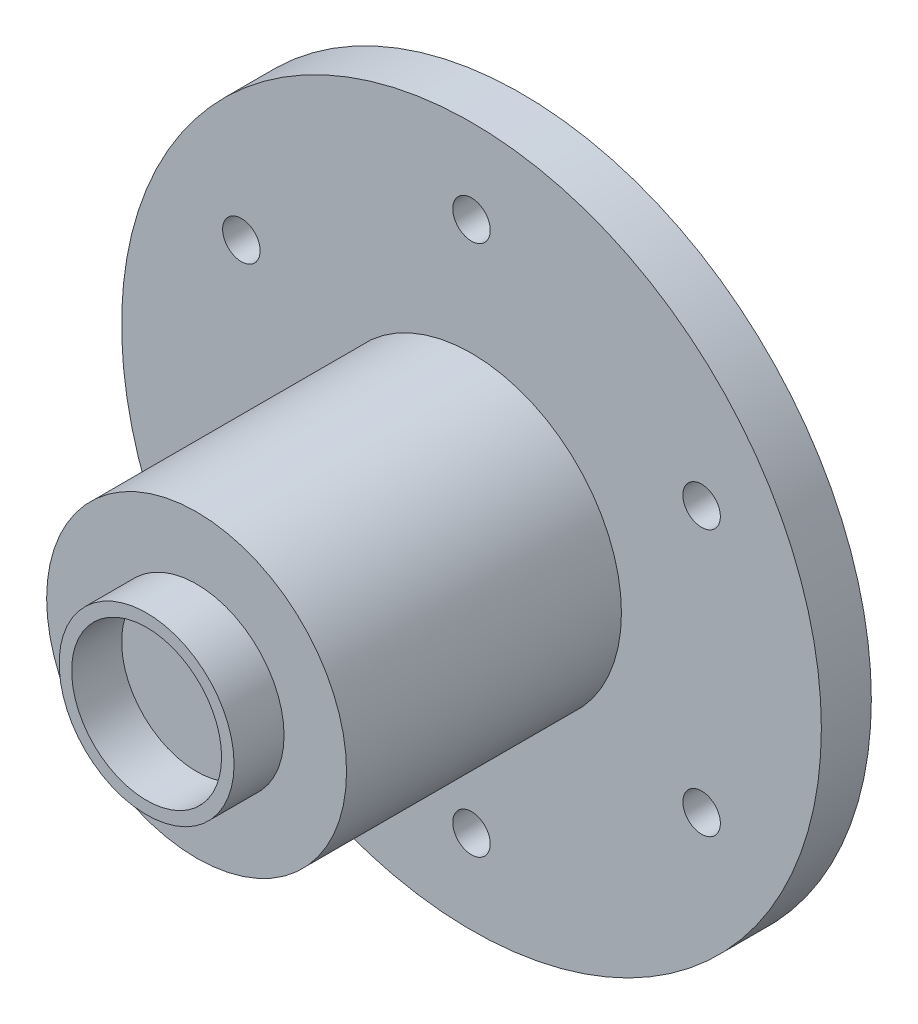
ISO-10303-21;
HEADER;
FILE_DESCRIPTION(('STEP AP214'),'2;1');
FILE_NAME('part.step','',(''),(''),'','','');
FILE_SCHEMA(('AUTOMOTIVE_DESIGN { 1 0 10303 214 1 1 1 1 }'));
ENDSEC;
DATA;
#1=APPLICATION_CONTEXT('core data for automotive mechanical design processes');
#2=APPLICATION_PROTOCOL_DEFINITION('international standard','automotive_design',2000,#1);
#3=PRODUCT_CONTEXT('',#1,'mechanical');
#4=PRODUCT('Part','Part','',(#3));
#5=PRODUCT_RELATED_PRODUCT_CATEGORY('part','',(#4));
#6=PRODUCT_DEFINITION_FORMATION('','',#4);
#7=PRODUCT_DEFINITION_CONTEXT('part definition',#1,'design');
#8=PRODUCT_DEFINITION('design','',#6,#7);
#9=PRODUCT_DEFINITION_SHAPE('','',#8);
#10=(LENGTH_UNIT() NAMED_UNIT(*) SI_UNIT(.MILLI.,.METRE.));
#11=(NAMED_UNIT(*) PLANE_ANGLE_UNIT() SI_UNIT($,.RADIAN.));
#12=(NAMED_UNIT(*) SI_UNIT($,.STERADIAN.) SOLID_ANGLE_UNIT());
#13=UNCERTAINTY_MEASURE_WITH_UNIT(LENGTH_MEASURE(1.E-05),#10,'distance_accuracy_value','');
#14=(GEOMETRIC_REPRESENTATION_CONTEXT(3) GLOBAL_UNCERTAINTY_ASSIGNED_CONTEXT((#13)) GLOBAL_UNIT_ASSIGNED_CONTEXT((#10,
#11,#12)) REPRESENTATION_CONTEXT('',''));
#15=CARTESIAN_POINT('',(0.,0.,0.));
#16=DIRECTION('',(0.,0.,1.));
#17=DIRECTION('',(1.,0.,0.));
#18=AXIS2_PLACEMENT_3D('',#15,#16,#17);
#19=CARTESIAN_POINT('',(0.,0.,-34.));
#20=DIRECTION('',(0.,0.,1.));
#21=DIRECTION('',(1.,0.,0.));
#22=AXIS2_PLACEMENT_3D('',#19,#20,#21);
#23=CYLINDRICAL_SURFACE('',#22,5.);
#24=CARTESIAN_POINT('',(0.,0.,0.));
#25=DIRECTION('',(0.,0.,1.));
#26=DIRECTION('',(1.,0.,0.));
#27=AXIS2_PLACEMENT_3D('',#24,#25,#26);
#28=CIRCLE('',#27,5.);
#29=CARTESIAN_POINT('',(5.,0.,0.));
#30=VERTEX_POINT('',#29);
#31=EDGE_CURVE('E123',#30,#30,#28,.T.);
#32=ORIENTED_EDGE('',*,*,#31,.F.);
#33=EDGE_LOOP('',(#32));
#34=FACE_BOUND('',#33,.T.);
#35=CARTESIAN_POINT('',(0.,-5.,17.723306720916));
#36=CARTESIAN_POINT('',(-0.0822886127532998,-4.9999992925055,17.7233057234311));
#37=CARTESIAN_POINT('',(-0.164587318351529,-4.99794915693954,17.716512857292));
#38=CARTESIAN_POINT('',(-0.32678812530488,-4.98997105593691,17.6895853666939));
#39=CARTESIAN_POINT('',(-0.406689504411419,-4.98404193389692,17.6694467628927));
#40=CARTESIAN_POINT('',(-0.561732707754526,-4.96895552501836,17.6165607040057));
#41=CARTESIAN_POINT('',(-0.636881364395372,-4.95980300250425,17.5838318512971));
#42=CARTESIAN_POINT('',(-0.78062418105313,-4.93922109237645,17.5067706278602));
#43=CARTESIAN_POINT('',(-0.849217467469668,-4.92779140192067,17.4624367135206));
#44=CARTESIAN_POINT('',(-0.979871797183743,-4.90350737192774,17.3620827134433));
#45=CARTESIAN_POINT('',(-1.04171807124434,-4.89062383657036,17.3057900950301));
#46=CARTESIAN_POINT('',(-1.15524920923324,-4.86505834210442,17.1836974910058));
#47=CARTESIAN_POINT('',(-1.20693236327441,-4.85237641724501,17.117895908791));
#48=CARTESIAN_POINT('',(-1.29980037723707,-4.82834113993772,16.9768359678784));
#49=CARTESIAN_POINT('',(-1.34072309022213,-4.81702406663875,16.9013982599253));
#50=CARTESIAN_POINT('',(-1.4092139477476,-4.79743620394031,16.7443174666857));
#51=CARTESIAN_POINT('',(-1.43678529919973,-4.78916468313311,16.662675876988));
#52=CARTESIAN_POINT('',(-1.47701633682652,-4.77690870838434,16.4979164547855));
#53=CARTESIAN_POINT('',(-1.49007196234677,-4.77281069324533,16.414903977052));
#54=CARTESIAN_POINT('',(-1.50213730614672,-4.76902789749767,16.2477735646992));
#55=CARTESIAN_POINT('',(-1.50115042761078,-4.76934204760571,16.1636559028569));
#56=CARTESIAN_POINT('',(-1.48546977199812,-4.77424744067778,15.9999228123075));
#57=CARTESIAN_POINT('',(-1.47127205262685,-4.7786838859914,15.9202544705538));
#58=CARTESIAN_POINT('',(-1.43037420427056,-4.79108356228624,15.7644869346425));
#59=CARTESIAN_POINT('',(-1.40367284141641,-4.79904714132351,15.6883880935417));
#60=CARTESIAN_POINT('',(-1.33816026653682,-4.81772733074973,15.5407063712553));
#61=CARTESIAN_POINT('',(-1.29918816934643,-4.82848016115952,15.4691996369607));
#62=CARTESIAN_POINT('',(-1.21035222588683,-4.85150987000064,15.3335746989058));
#63=CARTESIAN_POINT('',(-1.16048574002588,-4.86378711746991,15.2694582915022));
#64=CARTESIAN_POINT('',(-1.04881290765546,-4.88911011297937,15.147620530154));
#65=CARTESIAN_POINT('',(-0.986594907466972,-4.90216654310498,15.0902780568863));
#66=CARTESIAN_POINT('',(-0.853263259313967,-4.92712244063259,14.9867527368517));
#67=CARTESIAN_POINT('',(-0.782149051860888,-4.9390218351841,14.9405705925016));
#68=CARTESIAN_POINT('',(-0.632355038342804,-4.9604316006947,14.8604467984513));
#69=CARTESIAN_POINT('',(-0.553627749747951,-4.96992543668314,14.8265892046661));
#70=CARTESIAN_POINT('',(-0.391245415603519,-4.98533521832222,14.7727071308164));
#71=CARTESIAN_POINT('',(-0.307591751589582,-4.99125216186999,14.7526787923835));
#72=CARTESIAN_POINT('',(-0.140952242668332,-4.99868364643538,14.7276545430166));
#73=CARTESIAN_POINT('',(-0.0580500976011873,-5.0003485041779,14.7221451351144));
#74=CARTESIAN_POINT('',(0.107499605823383,-4.9995292324176,14.7248758766281));
#75=CARTESIAN_POINT('',(0.19014719669078,-4.99704565677756,14.7331141905674));
#76=CARTESIAN_POINT('',(0.350903605309696,-4.98830696987163,14.7626913320275));
#77=CARTESIAN_POINT('',(0.429072772614169,-4.98213829799417,14.7837301084969));
#78=CARTESIAN_POINT('',(0.580754638954521,-4.96674347841533,14.8379499536942));
#79=CARTESIAN_POINT('',(0.654266777025583,-4.95751696321085,14.8711324819539));
#80=CARTESIAN_POINT('',(0.796437189461052,-4.93669654351325,14.9495598863971));
#81=CARTESIAN_POINT('',(0.864943826199669,-4.92505280829675,14.995066061864));
#82=CARTESIAN_POINT('',(0.993523307980147,-4.90073468764318,15.0965314749688));
#83=CARTESIAN_POINT('',(1.05359403235593,-4.8880600443108,15.1524933328037));
#84=CARTESIAN_POINT('',(1.16585744551027,-4.86253171869138,15.2756940292853));
#85=CARTESIAN_POINT('',(1.21768481231504,-4.84968825033268,15.3432685966877));
#86=CARTESIAN_POINT('',(1.30928995072154,-4.82576515238463,15.4864346599295));
#87=CARTESIAN_POINT('',(1.34906803829472,-4.81468547654651,15.5620259454742));
#88=CARTESIAN_POINT('',(1.41517347127168,-4.79567189615055,15.7188392121707));
#89=CARTESIAN_POINT('',(1.4415634693705,-4.78772337843827,15.8000329074526));
#90=CARTESIAN_POINT('',(1.48021730815114,-4.77591594362794,15.9659946898475));
#91=CARTESIAN_POINT('',(1.49248598978779,-4.772055625083,16.0507615417037));
#92=CARTESIAN_POINT('',(1.50221984485059,-4.76899972496087,16.2176682392922));
#93=CARTESIAN_POINT('',(1.5002805530849,-4.76961647442754,16.2997703719336));
#94=CARTESIAN_POINT('',(1.48307505444813,-4.77499401288294,16.4624208242888));
#95=CARTESIAN_POINT('',(1.46780938124716,-4.77975463592551,16.5429692060923));
#96=CARTESIAN_POINT('',(1.42476888804136,-4.79275763670385,16.6992521200588));
#97=CARTESIAN_POINT('',(1.39715175507069,-4.80095604545965,16.7750340082777));
#98=CARTESIAN_POINT('',(1.33031507121129,-4.81990278909136,16.9209491597337));
#99=CARTESIAN_POINT('',(1.29109329962876,-4.83065161194312,16.9910813385567));
#100=CARTESIAN_POINT('',(1.20048763805072,-4.85397676425833,17.1264698374431));
#101=CARTESIAN_POINT('',(1.14871276092994,-4.86660540163797,17.1914554821764));
#102=CARTESIAN_POINT('',(1.03517434629782,-4.89201320450026,17.3120092192239));
#103=CARTESIAN_POINT('',(0.973408217134502,-4.90479240823905,17.3675748603838));
#104=CARTESIAN_POINT('',(0.839465762183249,-4.92950936570649,17.469330133211));
#105=CARTESIAN_POINT('',(0.767037885790609,-4.94141159765674,17.5151981677715));
#106=CARTESIAN_POINT('',(0.615141373983531,-4.96260680455813,17.59404189082));
#107=CARTESIAN_POINT('',(0.535676052998956,-4.97190099931067,17.6270236091905));
#108=CARTESIAN_POINT('',(0.380757712655282,-4.98602174969301,17.6762019965687));
#109=CARTESIAN_POINT('',(0.305786961954235,-4.99122027381068,17.6938183937992));
#110=CARTESIAN_POINT('',(0.15388019523078,-4.99820944494492,17.7173702461576));
#111=CARTESIAN_POINT('',(0.0769445098581401,-5.0000006615474,17.7233076536208));
#112=CARTESIAN_POINT('',(0.,-5.,17.723306720916));
#113=B_SPLINE_CURVE_WITH_KNOTS('',3,(#35,#36,#37,#38,#39,#40,#41,#42,#43,#44,#45,#46,#47,#48,
#49,#50,#51,#52,#53,#54,#55,#56,#57,#58,#59,#60,#61,#62,#63,#64,#65,#66,#67,#68,#69,#70,#71,#72,
#73,#74,#75,#76,#77,#78,#79,#80,#81,#82,#83,#84,#85,#86,#87,#88,#89,#90,#91,#92,#93,#94,#95,#96,
#97,#98,#99,#100,#101,#102,#103,#104,#105,#106,#107,#108,#109,#110,#111,#112),.UNSPECIFIED.,.T.,
.F.,(4,2,2,2,2,2,2,2,2,2,2,2,2,2,2,2,2,2,2,2,2,2,2,2,2,2,2,2,2,2,2,2,2,2,2,2,2,2,4),(0.,
0.24658320361261,0.493239964845999,0.739533676300873,0.985860164412701,1.23855602948191,
1.49129437288633,1.74971481004109,2.00807314543224,2.25919689356599,2.51025978319089,
2.75226016697676,2.99428443658001,3.23962426447119,3.48502360158555,3.74067104048167,
3.99633456531072,4.25371046881689,4.51101453528808,4.75908809438545,5.00712853550327,
5.24956746682327,5.49203554593729,5.74011305702908,5.98825282000191,6.24540400322819,
6.5025484425268,6.75847814951252,7.01432009460283,7.25950155466943,7.50467319661599,
7.74680040402721,7.98897397553107,8.23996925679931,8.49102974897502,8.74942996156671,
9.00770911595235,9.2383169193046,9.46888616948875),.UNSPECIFIED.);
#114=CARTESIAN_POINT('',(0.,-5.,17.723306720916));
#115=VERTEX_POINT('',#114);
#116=EDGE_CURVE('E56',#115,#115,#113,.T.);
#117=ORIENTED_EDGE('',*,*,#116,.T.);
#118=EDGE_LOOP('',(#117));
#119=FACE_BOUND('',#118,.T.);
#120=CARTESIAN_POINT('',(0.,0.,20.));
#121=DIRECTION('',(0.,0.,1.));
#122=DIRECTION('',(1.,0.,0.));
#123=AXIS2_PLACEMENT_3D('',#120,#121,#122);
#124=CIRCLE('',#123,5.);
#125=CARTESIAN_POINT('',(5.,0.,20.));
#126=VERTEX_POINT('',#125);
#127=EDGE_CURVE('E10',#126,#126,#124,.F.);
#128=ORIENTED_EDGE('',*,*,#127,.F.);
#129=EDGE_LOOP('',(#128));
#130=FACE_BOUND('',#129,.T.);
#131=ADVANCED_FACE('F39',(#34,#119,#130),#23,.F.);
#132=CARTESIAN_POINT('',(0.,0.,4.));
#133=DIRECTION('',(0.,0.,-1.));
#134=DIRECTION('',(-1.,0.,0.));
#135=AXIS2_PLACEMENT_3D('',#132,#133,#134);
#136=CYLINDRICAL_SURFACE('',#135,28.);
#137=CARTESIAN_POINT('',(0.,0.,4.));
#138=DIRECTION('',(0.,0.,1.));
#139=DIRECTION('',(1.,0.,0.));
#140=AXIS2_PLACEMENT_3D('',#137,#138,#139);
#141=CIRCLE('',#140,28.);
#142=CARTESIAN_POINT('',(28.,0.,4.));
#143=VERTEX_POINT('',#142);
#144=EDGE_CURVE('E53',#143,#143,#141,.T.);
#145=ORIENTED_EDGE('',*,*,#144,.F.);
#146=EDGE_LOOP('',(#145));
#147=FACE_BOUND('',#146,.T.);
#148=CARTESIAN_POINT('',(0.,0.,0.));
#149=DIRECTION('',(0.,0.,1.));
#150=DIRECTION('',(1.,0.,0.));
#151=AXIS2_PLACEMENT_3D('',#148,#149,#150);
#152=CIRCLE('',#151,28.);
#153=CARTESIAN_POINT('',(28.,0.,0.));
#154=VERTEX_POINT('',#153);
#155=EDGE_CURVE('E66',#154,#154,#152,.T.);
#156=ORIENTED_EDGE('',*,*,#155,.T.);
#157=EDGE_LOOP('',(#156));
#158=FACE_BOUND('',#157,.T.);
#159=ADVANCED_FACE('F41',(#147,#158),#136,.T.);
#160=CARTESIAN_POINT('',(0.,0.,4.));
#161=DIRECTION('',(0.,0.,1.));
#162=DIRECTION('',(1.,0.,0.));
#163=AXIS2_PLACEMENT_3D('',#160,#161,#162);
#164=PLANE('',#163);
#165=CARTESIAN_POINT('',(18.4165890262439,10.6328226318569,4.));
#166=DIRECTION('',(0.,0.,1.));
#167=DIRECTION('',(0.50000000000001,-0.866025403784433,0.));
#168=AXIS2_PLACEMENT_3D('',#165,#166,#167);
#169=CIRCLE('',#168,1.5);
#170=CARTESIAN_POINT('',(19.1665890262439,9.33378452618028,4.));
#171=VERTEX_POINT('',#170);
#172=EDGE_CURVE('E93',#171,#171,#169,.T.);
#173=ORIENTED_EDGE('',*,*,#172,.F.);
#174=EDGE_LOOP('',(#173));
#175=FACE_BOUND('',#174,.T.);
#176=CARTESIAN_POINT('',(18.4165890262442,-10.6328226318565,4.));
#177=DIRECTION('',(0.,0.,1.));
#178=DIRECTION('',(-0.499999999999992,-0.866025403784443,0.));
#179=AXIS2_PLACEMENT_3D('',#176,#177,#178);
#180=CIRCLE('',#179,1.5);
#181=CARTESIAN_POINT('',(17.6665890262442,-11.9318607375332,4.));
#182=VERTEX_POINT('',#181);
#183=EDGE_CURVE('E167',#182,#182,#180,.T.);
#184=ORIENTED_EDGE('',*,*,#183,.F.);
#185=EDGE_LOOP('',(#184));
#186=FACE_BOUND('',#185,.T.);
#187=CARTESIAN_POINT('',(0.,-21.2656452637134,4.));
#188=DIRECTION('',(0.,0.,1.));
#189=DIRECTION('',(-1.,0.,0.));
#190=AXIS2_PLACEMENT_3D('',#187,#188,#189);
#191=CIRCLE('',#190,1.5);
#192=CARTESIAN_POINT('',(-1.5,-21.2656452637134,4.));
#193=VERTEX_POINT('',#192);
#194=EDGE_CURVE('E175',#193,#193,#191,.T.);
#195=ORIENTED_EDGE('',*,*,#194,.F.);
#196=EDGE_LOOP('',(#195));
#197=FACE_BOUND('',#196,.T.);
#198=CARTESIAN_POINT('',(-18.416589026244,-10.6328226318568,4.));
#199=DIRECTION('',(0.,0.,1.));
#200=DIRECTION('',(-0.500000000000004,0.866025403784436,0.));
#201=AXIS2_PLACEMENT_3D('',#198,#199,#200);
#202=CIRCLE('',#201,1.5);
#203=CARTESIAN_POINT('',(-19.166589026244,-9.33378452618014,4.));
#204=VERTEX_POINT('',#203);
#205=EDGE_CURVE('E96',#204,#204,#202,.T.);
#206=ORIENTED_EDGE('',*,*,#205,.F.);
#207=EDGE_LOOP('',(#206));
#208=FACE_BOUND('',#207,.T.);
#209=CARTESIAN_POINT('',(-18.4165890262441,10.6328226318567,4.));
#210=DIRECTION('',(0.,0.,1.));
#211=DIRECTION('',(0.499999999999998,0.86602540378444,0.));
#212=AXIS2_PLACEMENT_3D('',#209,#210,#211);
#213=CIRCLE('',#212,1.5);
#214=CARTESIAN_POINT('',(-17.6665890262441,11.9318607375333,4.));
#215=VERTEX_POINT('',#214);
#216=EDGE_CURVE('E158',#215,#215,#213,.T.);
#217=ORIENTED_EDGE('',*,*,#216,.F.);
#218=EDGE_LOOP('',(#217));
#219=FACE_BOUND('',#218,.T.);
#220=CARTESIAN_POINT('',(0.,21.2656452637134,4.));
#221=DIRECTION('',(0.,0.,1.));
#222=DIRECTION('',(1.,0.,0.));
#223=AXIS2_PLACEMENT_3D('',#220,#221,#222);
#224=CIRCLE('',#223,1.5);
#225=CARTESIAN_POINT('',(1.5,21.2656452637134,4.));
#226=VERTEX_POINT('',#225);
#227=EDGE_CURVE('E146',#226,#226,#224,.T.);
#228=ORIENTED_EDGE('',*,*,#227,.F.);
#229=EDGE_LOOP('',(#228));
#230=FACE_BOUND('',#229,.T.);
#231=CARTESIAN_POINT('',(0.,0.,4.));
#232=DIRECTION('',(0.,0.,1.));
#233=DIRECTION('',(1.,0.,0.));
#234=AXIS2_PLACEMENT_3D('',#231,#232,#233);
#235=CIRCLE('',#234,12.);
#236=CARTESIAN_POINT('',(12.,0.,4.));
#237=VERTEX_POINT('',#236);
#238=EDGE_CURVE('E48',#237,#237,#235,.T.);
#239=ORIENTED_EDGE('',*,*,#238,.F.);
#240=EDGE_LOOP('',(#239));
#241=FACE_BOUND('',#240,.T.);
#242=ORIENTED_EDGE('',*,*,#144,.T.);
#243=EDGE_LOOP('',(#242));
#244=FACE_BOUND('',#243,.T.);
#245=ADVANCED_FACE('F105',(#175,#186,#197,#208,#219,#230,#241,#244),#164,.T.);
#246=CARTESIAN_POINT('',(0.,0.,0.));
#247=DIRECTION('',(0.,0.,1.));
#248=DIRECTION('',(1.,0.,0.));
#249=AXIS2_PLACEMENT_3D('',#246,#247,#248);
#250=PLANE('',#249);
#251=CARTESIAN_POINT('',(18.4165890262439,10.6328226318569,0.));
#252=DIRECTION('',(0.,0.,-1.));
#253=DIRECTION('',(-0.50000000000001,0.866025403784433,0.));
#254=AXIS2_PLACEMENT_3D('',#251,#252,#253);
#255=CIRCLE('',#254,1.5);
#256=CARTESIAN_POINT('',(17.6665890262439,11.9318607375336,0.));
#257=VERTEX_POINT('',#256);
#258=EDGE_CURVE('E163',#257,#257,#255,.T.);
#259=ORIENTED_EDGE('',*,*,#258,.F.);
#260=EDGE_LOOP('',(#259));
#261=FACE_BOUND('',#260,.T.);
#262=CARTESIAN_POINT('',(18.4165890262442,-10.6328226318565,0.));
#263=DIRECTION('',(0.,0.,-1.));
#264=DIRECTION('',(0.499999999999992,0.866025403784443,0.));
#265=AXIS2_PLACEMENT_3D('',#262,#263,#264);
#266=CIRCLE('',#265,1.5);
#267=CARTESIAN_POINT('',(19.1665890262441,-9.33378452617987,0.));
#268=VERTEX_POINT('',#267);
#269=EDGE_CURVE('E171',#268,#268,#266,.T.);
#270=ORIENTED_EDGE('',*,*,#269,.F.);
#271=EDGE_LOOP('',(#270));
#272=FACE_BOUND('',#271,.T.);
#273=CARTESIAN_POINT('',(0.,-21.2656452637134,0.));
#274=DIRECTION('',(0.,0.,-1.));
#275=DIRECTION('',(1.,0.,0.));
#276=AXIS2_PLACEMENT_3D('',#273,#274,#275);
#277=CIRCLE('',#276,1.5);
#278=CARTESIAN_POINT('',(1.5,-21.2656452637134,0.));
#279=VERTEX_POINT('',#278);
#280=EDGE_CURVE('E179',#279,#279,#277,.T.);
#281=ORIENTED_EDGE('',*,*,#280,.F.);
#282=EDGE_LOOP('',(#281));
#283=FACE_BOUND('',#282,.T.);
#284=CARTESIAN_POINT('',(-18.416589026244,-10.6328226318568,0.));
#285=DIRECTION('',(0.,0.,-1.));
#286=DIRECTION('',(0.500000000000004,-0.866025403784436,0.));
#287=AXIS2_PLACEMENT_3D('',#284,#285,#286);
#288=CIRCLE('',#287,1.5);
#289=CARTESIAN_POINT('',(-17.666589026244,-11.9318607375335,0.));
#290=VERTEX_POINT('',#289);
#291=EDGE_CURVE('E162',#290,#290,#288,.T.);
#292=ORIENTED_EDGE('',*,*,#291,.F.);
#293=EDGE_LOOP('',(#292));
#294=FACE_BOUND('',#293,.T.);
#295=CARTESIAN_POINT('',(-18.4165890262441,10.6328226318567,0.));
#296=DIRECTION('',(0.,0.,-1.));
#297=DIRECTION('',(-0.499999999999998,-0.86602540378444,0.));
#298=AXIS2_PLACEMENT_3D('',#295,#296,#297);
#299=CIRCLE('',#298,1.5);
#300=CARTESIAN_POINT('',(-19.1665890262441,9.33378452618001,0.));
#301=VERTEX_POINT('',#300);
#302=EDGE_CURVE('E154',#301,#301,#299,.T.);
#303=ORIENTED_EDGE('',*,*,#302,.F.);
#304=EDGE_LOOP('',(#303));
#305=FACE_BOUND('',#304,.T.);
#306=CARTESIAN_POINT('',(0.,21.2656452637134,0.));
#307=DIRECTION('',(0.,0.,-1.));
#308=DIRECTION('',(-1.,0.,0.));
#309=AXIS2_PLACEMENT_3D('',#306,#307,#308);
#310=CIRCLE('',#309,1.5);
#311=CARTESIAN_POINT('',(-1.5,21.2656452637134,0.));
#312=VERTEX_POINT('',#311);
#313=EDGE_CURVE('E150',#312,#312,#310,.T.);
#314=ORIENTED_EDGE('',*,*,#313,.F.);
#315=EDGE_LOOP('',(#314));
#316=FACE_BOUND('',#315,.T.);
#317=ORIENTED_EDGE('',*,*,#31,.T.);
#318=EDGE_LOOP('',(#317));
#319=FACE_BOUND('',#318,.T.);
#320=ORIENTED_EDGE('',*,*,#155,.F.);
#321=EDGE_LOOP('',(#320));
#322=FACE_BOUND('',#321,.T.);
#323=ADVANCED_FACE('F103',(#261,#272,#283,#294,#305,#316,#319,#322),#250,.F.);
#324=CARTESIAN_POINT('',(0.,0.,26.));
#325=DIRECTION('',(0.,0.,-1.));
#326=DIRECTION('',(-1.,0.,0.));
#327=AXIS2_PLACEMENT_3D('',#324,#325,#326);
#328=CYLINDRICAL_SURFACE('',#327,12.);
#329=CARTESIAN_POINT('',(0.,-12.,17.723306720916));
#330=CARTESIAN_POINT('',(0.0839046573334568,-11.9999988293786,17.7233031563546));
#331=CARTESIAN_POINT('',(0.167861744581648,-11.9991107073294,17.7162429934144));
#332=CARTESIAN_POINT('',(0.333439681253851,-11.9956532406682,17.6881900681735));
#333=CARTESIAN_POINT('',(0.415057998374247,-11.9930821406486,17.667182758162));
#334=CARTESIAN_POINT('',(0.573537344887832,-11.9865483662664,17.6118641345675));
#335=CARTESIAN_POINT('',(0.650401536087682,-11.9825866287333,17.5775617758301));
#336=CARTESIAN_POINT('',(0.797267684935821,-11.9737122052686,17.4966463505341));
#337=CARTESIAN_POINT('',(0.867270816933823,-11.9687996825047,17.4500353957976));
#338=CARTESIAN_POINT('',(0.998827690158791,-11.958541927838,17.3455515510122));
#339=CARTESIAN_POINT('',(1.06033821896228,-11.9531946881545,17.2876244433082));
#340=CARTESIAN_POINT('',(1.1727916761345,-11.9426863560585,17.162269026794));
#341=CARTESIAN_POINT('',(1.22373406583535,-11.9375252731456,17.094840233968));
#342=CARTESIAN_POINT('',(1.31376609677036,-11.9279538337175,16.9521147343766));
#343=CARTESIAN_POINT('',(1.35281525756464,-11.9235460630675,16.8767923039752));
#344=CARTESIAN_POINT('',(1.41769384594507,-11.9160067707461,16.7205944897476));
#345=CARTESIAN_POINT('',(1.44352377483913,-11.9128752006788,16.6397193166278));
#346=CARTESIAN_POINT('',(1.48109938801486,-11.9082620376217,16.4751602035639));
#347=CARTESIAN_POINT('',(1.49291802883902,-11.9067719006205,16.3914931662935));
#348=CARTESIAN_POINT('',(1.50236132973434,-11.9055841688568,16.2233509628329));
#349=CARTESIAN_POINT('',(1.49998656060145,-11.905886502009,16.1388758292772));
#350=CARTESIAN_POINT('',(1.48117034186874,-11.9082417322185,15.9720238245667));
#351=CARTESIAN_POINT('',(1.46480925779082,-11.910284627762,15.8896377291958));
#352=CARTESIAN_POINT('',(1.41861022990923,-11.9158751985458,15.7287897081846));
#353=CARTESIAN_POINT('',(1.38877201305114,-11.9194229042743,15.6503278620876));
#354=CARTESIAN_POINT('',(1.31637933594699,-11.9276346951879,15.499305921503));
#355=CARTESIAN_POINT('',(1.27378995222458,-11.9323018392687,15.4267627407666));
#356=CARTESIAN_POINT('',(1.17712888167415,-11.9422242685836,15.289822704268));
#357=CARTESIAN_POINT('',(1.12305666964847,-11.947479580714,15.2254262213318));
#358=CARTESIAN_POINT('',(1.00451946645227,-11.9580306593426,15.1061410944823));
#359=CARTESIAN_POINT('',(0.939985204704007,-11.9633264543213,15.0513212658564));
#360=CARTESIAN_POINT('',(0.802594301468354,-11.9733277953351,14.9532813928977));
#361=CARTESIAN_POINT('',(0.729737640790951,-11.978033340009,14.9100613753128));
#362=CARTESIAN_POINT('',(0.577717002818089,-11.9863269133115,14.8364479286376));
#363=CARTESIAN_POINT('',(0.49855091720263,-11.9899145664092,14.8060588085873));
#364=CARTESIAN_POINT('',(0.336184764258634,-11.9955647146804,14.759024424802));
#365=CARTESIAN_POINT('',(0.252984885978401,-11.9976272812552,14.7423785176338));
#366=CARTESIAN_POINT('',(0.0855078983480986,-11.9999855784646,14.7233922663597));
#367=CARTESIAN_POINT('',(0.0012416941191642,-12.0002930168558,14.7209571254976));
#368=CARTESIAN_POINT('',(-0.166497621898498,-11.9991380280326,14.7302113613496));
#369=CARTESIAN_POINT('',(-0.249970750538824,-11.9976756385093,14.7419004372669));
#370=CARTESIAN_POINT('',(-0.413474704632913,-11.9931526125402,14.7789925461806));
#371=CARTESIAN_POINT('',(-0.493515942254824,-11.9900972448832,14.8043503789576));
#372=CARTESIAN_POINT('',(-0.648209792915044,-11.9827303386012,14.8680131920637));
#373=CARTESIAN_POINT('',(-0.722862222879188,-11.9784187573237,14.9063186120108));
#374=CARTESIAN_POINT('',(-0.865082712412456,-11.9689909374607,14.9950186034205));
#375=CARTESIAN_POINT('',(-0.932612255966292,-11.9638706642551,15.0454744947994));
#376=CARTESIAN_POINT('',(-1.05827819377579,-11.9534108539539,15.1569564194365));
#377=CARTESIAN_POINT('',(-1.11641421500211,-11.9480713081614,15.2179828722666));
#378=CARTESIAN_POINT('',(-1.22197917529081,-11.9377386327755,15.3492911709703));
#379=CARTESIAN_POINT('',(-1.26934527634076,-11.932747648328,15.4196237287022));
#380=CARTESIAN_POINT('',(-1.3515917336661,-11.9237124662229,15.5673016678288));
#381=CARTESIAN_POINT('',(-1.38647234023702,-11.9196682495862,15.6446469086019));
#382=CARTESIAN_POINT('',(-1.44265594731992,-11.912999102358,15.8039519124046));
#383=CARTESIAN_POINT('',(-1.46399437647427,-11.9103704711087,15.8858990189448));
#384=CARTESIAN_POINT('',(-1.49260199632071,-11.9068194954447,16.0522482111844));
#385=CARTESIAN_POINT('',(-1.49987184152146,-11.9058970716527,16.1366501824914));
#386=CARTESIAN_POINT('',(-1.5001239216509,-11.9058652618947,16.3048880784388));
#387=CARTESIAN_POINT('',(-1.49320487861956,-11.9067433485117,16.3887238699151));
#388=CARTESIAN_POINT('',(-1.4654846429096,-11.9101866872232,16.554030998523));
#389=CARTESIAN_POINT('',(-1.44468344874346,-11.9127519394985,16.6355023354013));
#390=CARTESIAN_POINT('',(-1.38982024421379,-11.9192766946473,16.7937548949758));
#391=CARTESIAN_POINT('',(-1.35576298858256,-11.9232356975567,16.8705377879291));
#392=CARTESIAN_POINT('',(-1.27536414129019,-11.9321026994689,17.017314713345));
#393=CARTESIAN_POINT('',(-1.22902239570575,-11.9370107103625,17.0873086607279));
#394=CARTESIAN_POINT('',(-1.1250037987595,-11.9472636285134,17.2190254561203));
#395=CARTESIAN_POINT('',(-1.06725337546497,-11.9526112325042,17.280689997489));
#396=CARTESIAN_POINT('',(-0.94221013618103,-11.9631169895574,17.3934908160168));
#397=CARTESIAN_POINT('',(-0.87491507348494,-11.9682750976535,17.4446246073806));
#398=CARTESIAN_POINT('',(-0.732399372512527,-11.9778423395205,17.5350779351792));
#399=CARTESIAN_POINT('',(-0.657149567757702,-11.9822485504698,17.5743518044555));
#400=CARTESIAN_POINT('',(-0.501109741380769,-11.9897858944604,17.6396494666658));
#401=CARTESIAN_POINT('',(-0.420325848522142,-11.9929184122175,17.6656876567281));
#402=CARTESIAN_POINT('',(-0.282603463180755,-11.9968003219665,17.6975423238188));
#403=CARTESIAN_POINT('',(-0.226533398110153,-11.9979943553727,17.7071900861052));
#404=CARTESIAN_POINT('',(-0.113650237927461,-11.9995945879751,17.7200734683319));
#405=CARTESIAN_POINT('',(-0.0568371482976164,-12.0000007929808,17.7233091355556));
#406=CARTESIAN_POINT('',(0.,-12.,17.723306720916));
#407=B_SPLINE_CURVE_WITH_KNOTS('',3,(#329,#330,#331,#332,#333,#334,#335,#336,#337,#338,#339,
#340,#341,#342,#343,#344,#345,#346,#347,#348,#349,#350,#351,#352,#353,#354,#355,#356,#357,#358,
#359,#360,#361,#362,#363,#364,#365,#366,#367,#368,#369,#370,#371,#372,#373,#374,#375,#376,#377,
#378,#379,#380,#381,#382,#383,#384,#385,#386,#387,#388,#389,#390,#391,#392,#393,#394,#395,#396,
#397,#398,#399,#400,#401,#402,#403,#404,#405,#406),.UNSPECIFIED.,.T.,.F.,(4,2,2,2,2,2,2,2,2,2,2,
2,2,2,2,2,2,2,2,2,2,2,2,2,2,2,2,2,2,2,2,2,2,2,2,2,2,2,4),(0.,0.251506363665748,
0.503275476566056,0.754875304909062,1.00643199354644,1.25922487921106,1.51203064680006,
1.76568750191322,2.01933473698084,2.27165535171793,2.52396581930798,2.77483617865015,
3.02571162099745,3.2772805577132,3.52886100308183,3.7821808688185,4.03550131867868,
4.28890677438963,4.54230036542268,4.79400167635153,5.04569762701157,5.29656632336038,
5.54744353847369,5.79961441757053,6.05179530825053,6.30541182904544,6.55902326532923,
6.81196844568555,7.06490185806374,7.31608140721329,7.56726098327729,7.81835054823893,
8.06944325947359,8.32221142615098,8.57503919082008,8.82882841822112,9.0823409921042,
9.25271305912577,9.42308386980262),.UNSPECIFIED.);
#408=CARTESIAN_POINT('',(0.,-12.,17.723306720916));
#409=VERTEX_POINT('',#408);
#410=EDGE_CURVE('E65',#409,#409,#407,.T.);
#411=ORIENTED_EDGE('',*,*,#410,.T.);
#412=EDGE_LOOP('',(#411));
#413=FACE_BOUND('',#412,.T.);
#414=CARTESIAN_POINT('',(0.,0.,26.));
#415=DIRECTION('',(0.,0.,1.));
#416=DIRECTION('',(1.,0.,0.));
#417=AXIS2_PLACEMENT_3D('',#414,#415,#416);
#418=CIRCLE('',#417,12.);
#419=CARTESIAN_POINT('',(12.,0.,26.));
#420=VERTEX_POINT('',#419);
#421=EDGE_CURVE('E132',#420,#420,#418,.T.);
#422=ORIENTED_EDGE('',*,*,#421,.F.);
#423=EDGE_LOOP('',(#422));
#424=FACE_BOUND('',#423,.T.);
#425=ORIENTED_EDGE('',*,*,#238,.T.);
#426=EDGE_LOOP('',(#425));
#427=FACE_BOUND('',#426,.T.);
#428=ADVANCED_FACE('F98',(#413,#424,#427),#328,.T.);
#429=CARTESIAN_POINT('',(0.,0.,26.));
#430=DIRECTION('',(0.,0.,1.));
#431=DIRECTION('',(1.,0.,0.));
#432=AXIS2_PLACEMENT_3D('',#429,#430,#431);
#433=PLANE('',#432);
#434=CARTESIAN_POINT('',(0.,0.,26.));
#435=DIRECTION('',(0.,0.,1.));
#436=DIRECTION('',(1.,0.,0.));
#437=AXIS2_PLACEMENT_3D('',#434,#435,#436);
#438=CIRCLE('',#437,7.);
#439=CARTESIAN_POINT('',(7.,0.,26.));
#440=VERTEX_POINT('',#439);
#441=EDGE_CURVE('E43',#440,#440,#438,.F.);
#442=ORIENTED_EDGE('',*,*,#441,.T.);
#443=EDGE_LOOP('',(#442));
#444=FACE_BOUND('',#443,.T.);
#445=ORIENTED_EDGE('',*,*,#421,.T.);
#446=EDGE_LOOP('',(#445));
#447=FACE_BOUND('',#446,.T.);
#448=ADVANCED_FACE('F102',(#444,#447),#433,.T.);
#449=CARTESIAN_POINT('',(0.,21.2656452637134,6.99999999999999));
#450=DIRECTION('',(0.,0.,-1.));
#451=DIRECTION('',(-1.,0.,0.));
#452=AXIS2_PLACEMENT_3D('',#449,#450,#451);
#453=CYLINDRICAL_SURFACE('',#452,1.5);
#454=ORIENTED_EDGE('',*,*,#227,.T.);
#455=EDGE_LOOP('',(#454));
#456=FACE_BOUND('',#455,.T.);
#457=ORIENTED_EDGE('',*,*,#313,.T.);
#458=EDGE_LOOP('',(#457));
#459=FACE_BOUND('',#458,.T.);
#460=ADVANCED_FACE('F199',(#456,#459),#453,.F.);
#461=CARTESIAN_POINT('',(-18.4165890262441,10.6328226318567,6.99999999999999));
#462=DIRECTION('',(0.,0.,-1.));
#463=DIRECTION('',(-0.499999999999998,-0.86602540378444,0.));
#464=AXIS2_PLACEMENT_3D('',#461,#462,#463);
#465=CYLINDRICAL_SURFACE('',#464,1.5);
#466=ORIENTED_EDGE('',*,*,#216,.T.);
#467=EDGE_LOOP('',(#466));
#468=FACE_BOUND('',#467,.T.);
#469=ORIENTED_EDGE('',*,*,#302,.T.);
#470=EDGE_LOOP('',(#469));
#471=FACE_BOUND('',#470,.T.);
#472=ADVANCED_FACE('F202',(#468,#471),#465,.F.);
#473=CARTESIAN_POINT('',(-18.416589026244,-10.6328226318568,6.99999999999999));
#474=DIRECTION('',(0.,0.,-1.));
#475=DIRECTION('',(0.500000000000004,-0.866025403784436,0.));
#476=AXIS2_PLACEMENT_3D('',#473,#474,#475);
#477=CYLINDRICAL_SURFACE('',#476,1.5);
#478=ORIENTED_EDGE('',*,*,#205,.T.);
#479=EDGE_LOOP('',(#478));
#480=FACE_BOUND('',#479,.T.);
#481=ORIENTED_EDGE('',*,*,#291,.T.);
#482=EDGE_LOOP('',(#481));
#483=FACE_BOUND('',#482,.T.);
#484=ADVANCED_FACE('F81',(#480,#483),#477,.F.);
#485=CARTESIAN_POINT('',(0.,-21.2656452637134,6.99999999999999));
#486=DIRECTION('',(0.,0.,-1.));
#487=DIRECTION('',(1.,0.,0.));
#488=AXIS2_PLACEMENT_3D('',#485,#486,#487);
#489=CYLINDRICAL_SURFACE('',#488,1.5);
#490=ORIENTED_EDGE('',*,*,#194,.T.);
#491=EDGE_LOOP('',(#490));
#492=FACE_BOUND('',#491,.T.);
#493=ORIENTED_EDGE('',*,*,#280,.T.);
#494=EDGE_LOOP('',(#493));
#495=FACE_BOUND('',#494,.T.);
#496=ADVANCED_FACE('F222',(#492,#495),#489,.F.);
#497=CARTESIAN_POINT('',(18.4165890262442,-10.6328226318565,6.99999999999999));
#498=DIRECTION('',(0.,0.,-1.));
#499=DIRECTION('',(0.499999999999992,0.866025403784443,0.));
#500=AXIS2_PLACEMENT_3D('',#497,#498,#499);
#501=CYLINDRICAL_SURFACE('',#500,1.5);
#502=ORIENTED_EDGE('',*,*,#183,.T.);
#503=EDGE_LOOP('',(#502));
#504=FACE_BOUND('',#503,.T.);
#505=ORIENTED_EDGE('',*,*,#269,.T.);
#506=EDGE_LOOP('',(#505));
#507=FACE_BOUND('',#506,.T.);
#508=ADVANCED_FACE('F219',(#504,#507),#501,.F.);
#509=CARTESIAN_POINT('',(18.4165890262439,10.6328226318569,6.99999999999999));
#510=DIRECTION('',(0.,0.,-1.));
#511=DIRECTION('',(-0.50000000000001,0.866025403784433,0.));
#512=AXIS2_PLACEMENT_3D('',#509,#510,#511);
#513=CYLINDRICAL_SURFACE('',#512,1.5);
#514=ORIENTED_EDGE('',*,*,#172,.T.);
#515=EDGE_LOOP('',(#514));
#516=FACE_BOUND('',#515,.T.);
#517=ORIENTED_EDGE('',*,*,#258,.T.);
#518=EDGE_LOOP('',(#517));
#519=FACE_BOUND('',#518,.T.);
#520=ADVANCED_FACE('F77',(#516,#519),#513,.F.);
#521=CARTESIAN_POINT('',(0.,-15.,16.223306720916));
#522=DIRECTION('',(0.,1.,0.));
#523=DIRECTION('',(0.,0.,1.));
#524=AXIS2_PLACEMENT_3D('',#521,#522,#523);
#525=CYLINDRICAL_SURFACE('',#524,1.5);
#526=ORIENTED_EDGE('',*,*,#116,.F.);
#527=EDGE_LOOP('',(#526));
#528=FACE_BOUND('',#527,.T.);
#529=ORIENTED_EDGE('',*,*,#410,.F.);
#530=EDGE_LOOP('',(#529));
#531=FACE_BOUND('',#530,.T.);
#532=ADVANCED_FACE('F71',(#528,#531),#525,.F.);
#533=CARTESIAN_POINT('',(0.,0.,20.));
#534=DIRECTION('',(0.,0.,1.));
#535=DIRECTION('',(1.,0.,0.));
#536=AXIS2_PLACEMENT_3D('',#533,#534,#535);
#537=PLANE('',#536);
#538=ORIENTED_EDGE('',*,*,#127,.T.);
#539=EDGE_LOOP('',(#538));
#540=FACE_BOUND('',#539,.T.);
#541=ADVANCED_FACE('F76',(#540),#537,.F.);
#542=CARTESIAN_POINT('',(0.,0.,30.));
#543=DIRECTION('',(0.,0.,-1.));
#544=DIRECTION('',(-1.,0.,0.));
#545=AXIS2_PLACEMENT_3D('',#542,#543,#544);
#546=CYLINDRICAL_SURFACE('',#545,7.);
#547=ORIENTED_EDGE('',*,*,#441,.F.);
#548=EDGE_LOOP('',(#547));
#549=FACE_BOUND('',#548,.T.);
#550=CARTESIAN_POINT('',(0.,0.,30.));
#551=DIRECTION('',(0.,0.,1.));
#552=DIRECTION('',(1.,0.,0.));
#553=AXIS2_PLACEMENT_3D('',#550,#551,#552);
#554=CIRCLE('',#553,7.);
#555=CARTESIAN_POINT('',(7.,0.,30.));
#556=VERTEX_POINT('',#555);
#557=EDGE_CURVE('E94',#556,#556,#554,.T.);
#558=ORIENTED_EDGE('',*,*,#557,.F.);
#559=EDGE_LOOP('',(#558));
#560=FACE_BOUND('',#559,.T.);
#561=ADVANCED_FACE('F79',(#549,#560),#546,.T.);
#562=CARTESIAN_POINT('',(0.,0.,30.));
#563=DIRECTION('',(0.,0.,1.));
#564=DIRECTION('',(1.,0.,0.));
#565=AXIS2_PLACEMENT_3D('',#562,#563,#564);
#566=PLANE('',#565);
#567=CARTESIAN_POINT('',(0.,0.,30.));
#568=DIRECTION('',(0.,0.,1.));
#569=DIRECTION('',(1.,0.,0.));
#570=AXIS2_PLACEMENT_3D('',#567,#568,#569);
#571=CIRCLE('',#570,6.);
#572=CARTESIAN_POINT('',(6.,0.,30.));
#573=VERTEX_POINT('',#572);
#574=EDGE_CURVE('E342',#573,#573,#571,.T.);
#575=ORIENTED_EDGE('',*,*,#574,.F.);
#576=EDGE_LOOP('',(#575));
#577=FACE_BOUND('',#576,.T.);
#578=ORIENTED_EDGE('',*,*,#557,.T.);
#579=EDGE_LOOP('',(#578));
#580=FACE_BOUND('',#579,.T.);
#581=ADVANCED_FACE('F305',(#577,#580),#566,.T.);
#582=CARTESIAN_POINT('',(0.,0.,26.));
#583=DIRECTION('',(0.,0.,1.));
#584=DIRECTION('',(1.,0.,0.));
#585=AXIS2_PLACEMENT_3D('',#582,#583,#584);
#586=CYLINDRICAL_SURFACE('',#585,6.);
#587=CARTESIAN_POINT('',(0.,0.,26.));
#588=DIRECTION('',(0.,0.,1.));
#589=DIRECTION('',(1.,0.,0.));
#590=AXIS2_PLACEMENT_3D('',#587,#588,#589);
#591=CIRCLE('',#590,6.);
#592=CARTESIAN_POINT('',(6.,0.,26.));
#593=VERTEX_POINT('',#592);
#594=EDGE_CURVE('E340',#593,#593,#591,.T.);
#595=ORIENTED_EDGE('',*,*,#594,.F.);
#596=EDGE_LOOP('',(#595));
#597=FACE_BOUND('',#596,.T.);
#598=ORIENTED_EDGE('',*,*,#574,.T.);
#599=EDGE_LOOP('',(#598));
#600=FACE_BOUND('',#599,.T.);
#601=ADVANCED_FACE('F313',(#597,#600),#586,.F.);
#602=CARTESIAN_POINT('',(0.,0.,26.));
#603=DIRECTION('',(0.,0.,1.));
#604=DIRECTION('',(1.,0.,0.));
#605=AXIS2_PLACEMENT_3D('',#602,#603,#604);
#606=PLANE('',#605);
#607=ORIENTED_EDGE('',*,*,#594,.T.);
#608=EDGE_LOOP('',(#607));
#609=FACE_BOUND('',#608,.T.);
#610=ADVANCED_FACE('F322',(#609),#606,.T.);
#611=CLOSED_SHELL('',(#131,#159,#245,#323,#428,#448,#460,#472,#484,#496,#508,#520,#532,#541,
#561,#581,#601,#610));
#612=MANIFOLD_SOLID_BREP('B2',#611);
#613=ADVANCED_BREP_SHAPE_REPRESENTATION('',(#18,#612),#14);
#614=SHAPE_DEFINITION_REPRESENTATION(#9,#613);
ENDSEC;
END-ISO-10303-21;
